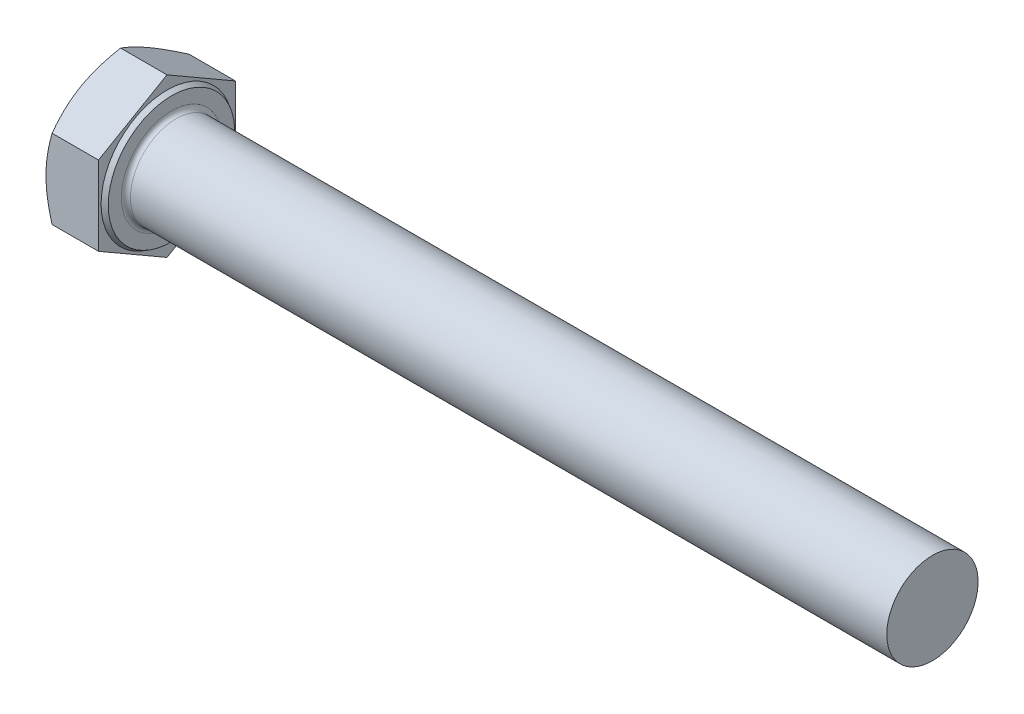
ISO-10303-21;
HEADER;
FILE_DESCRIPTION(('STEP AP214'),'2;1');
FILE_NAME('part.step','',(''),(''),'','','');
FILE_SCHEMA(('AUTOMOTIVE_DESIGN { 1 0 10303 214 1 1 1 1 }'));
ENDSEC;
DATA;
#1=APPLICATION_CONTEXT('core data for automotive mechanical design processes');
#2=APPLICATION_PROTOCOL_DEFINITION('international standard','automotive_design',2000,#1);
#3=PRODUCT_CONTEXT('',#1,'mechanical');
#4=PRODUCT('Part','Part','',(#3));
#5=PRODUCT_RELATED_PRODUCT_CATEGORY('part','',(#4));
#6=PRODUCT_DEFINITION_FORMATION('','',#4);
#7=PRODUCT_DEFINITION_CONTEXT('part definition',#1,'design');
#8=PRODUCT_DEFINITION('design','',#6,#7);
#9=PRODUCT_DEFINITION_SHAPE('','',#8);
#10=(LENGTH_UNIT() NAMED_UNIT(*) SI_UNIT(.MILLI.,.METRE.));
#11=(NAMED_UNIT(*) PLANE_ANGLE_UNIT() SI_UNIT($,.RADIAN.));
#12=(NAMED_UNIT(*) SI_UNIT($,.STERADIAN.) SOLID_ANGLE_UNIT());
#13=UNCERTAINTY_MEASURE_WITH_UNIT(LENGTH_MEASURE(1.E-05),#10,'distance_accuracy_value','');
#14=(GEOMETRIC_REPRESENTATION_CONTEXT(3) GLOBAL_UNCERTAINTY_ASSIGNED_CONTEXT((#13)) GLOBAL_UNIT_ASSIGNED_CONTEXT((#10,
#11,#12)) REPRESENTATION_CONTEXT('',''));
#15=CARTESIAN_POINT('',(0.,0.,0.));
#16=DIRECTION('',(0.,0.,1.));
#17=DIRECTION('',(1.,0.,0.));
#18=AXIS2_PLACEMENT_3D('',#15,#16,#17);
#19=CARTESIAN_POINT('',(7.5,5.19615242270662,-9.));
#20=DIRECTION('',(0.,-0.866025403784438,0.500000000000001));
#21=DIRECTION('',(0.,-0.500000000000001,-0.866025403784438));
#22=AXIS2_PLACEMENT_3D('',#19,#20,#21);
#23=PLANE('',#22);
#24=DIRECTION('',(0.,0.500000000000001,0.866025403784438));
#25=VECTOR('',#24,1.);
#26=CARTESIAN_POINT('',(6.9,5.19615242270662,-9.));
#27=LINE('',#26,#25);
#28=CARTESIAN_POINT('',(6.9,5.19615242270664,-9.));
#29=VERTEX_POINT('',#28);
#30=CARTESIAN_POINT('',(6.9,10.3923048454133,0.));
#31=VERTEX_POINT('',#30);
#32=EDGE_CURVE('E122',#29,#31,#27,.T.);
#33=ORIENTED_EDGE('',*,*,#32,.F.);
#34=DIRECTION('',(-1.,0.,0.));
#35=VECTOR('',#34,1.);
#36=CARTESIAN_POINT('',(7.5,5.19615242270662,-9.));
#37=LINE('',#36,#35);
#38=CARTESIAN_POINT('',(0.803847577293361,5.19615242270662,-9.));
#39=VERTEX_POINT('',#38);
#40=EDGE_CURVE('E271',#29,#39,#37,.T.);
#41=ORIENTED_EDGE('',*,*,#40,.T.);
#42=CARTESIAN_POINT('',(0.803914245071132,10.3924203154671,0.000200000000000029));
#43=CARTESIAN_POINT('',(0.737982001874055,10.2782163639798,-0.197607046401217));
#44=CARTESIAN_POINT('',(0.675041409210312,10.1635669787649,-0.396185606649945));
#45=CARTESIAN_POINT('',(0.555968997655536,9.93333715083391,-0.79495536604421));
#46=CARTESIAN_POINT('',(0.499840117752062,9.81775632901308,-0.99514722181845));
#47=CARTESIAN_POINT('',(0.395151960728962,9.58544915100228,-1.3975150570961));
#48=CARTESIAN_POINT('',(0.346610772912786,9.46872074181186,-1.5996945925006));
#49=CARTESIAN_POINT('',(0.25814851678792,9.23447001335913,-2.00542875589075));
#50=CARTESIAN_POINT('',(0.218225687483274,9.11694786135374,-2.20898309417891));
#51=CARTESIAN_POINT('',(0.148684674147114,8.88408932604662,-2.61230590830691));
#52=CARTESIAN_POINT('',(0.118837502847799,8.76877014301847,-2.812044592399));
#53=CARTESIAN_POINT('',(0.0687933098590807,8.53761579013205,-3.21241567598899));
#54=CARTESIAN_POINT('',(0.048595435537539,8.42178066677662,-3.4130479949416));
#55=CARTESIAN_POINT('',(0.0183543473973465,8.18990950036671,-3.81466063597382));
#56=CARTESIAN_POINT('',(0.0082996095843025,8.07387383570153,-4.01564030266393));
#57=CARTESIAN_POINT('',(-0.00143766485491865,7.84169571742973,-4.41778459991642));
#58=CARTESIAN_POINT('',(-0.00112052193524493,7.72555326723328,-4.61894922457222));
#59=CARTESIAN_POINT('',(0.00916395215317158,7.50842142195782,-4.9950326125305));
#60=CARTESIAN_POINT('',(0.0178767400303951,7.40741671639993,-5.16997789436029));
#61=CARTESIAN_POINT('',(0.0429773400653677,7.20564389241818,-5.51945867708335));
#62=CARTESIAN_POINT('',(0.0593656695806673,7.10487579040239,-5.69399414955697));
#63=CARTESIAN_POINT('',(0.119656556235828,6.80296159398079,-6.2169248772855));
#64=CARTESIAN_POINT('',(0.174677482341126,6.60234990505054,-6.56439451510491));
#65=CARTESIAN_POINT('',(0.312230476325148,6.1989985076226,-7.263019628754));
#66=CARTESIAN_POINT('',(0.395345618627104,5.99631027619253,-7.61408594368717));
#67=CARTESIAN_POINT('',(0.583982539436458,5.59395639760763,-8.3109833040186));
#68=CARTESIAN_POINT('',(0.689460012893352,5.39428559809852,-8.65682327355628));
#69=CARTESIAN_POINT('',(0.803914245071126,5.19603695265279,-9.0002));
#70=B_SPLINE_CURVE_WITH_KNOTS('',3,(#42,#43,#44,#45,#46,#47,#48,#49,#50,#51,#52,#53,#54,#55,#56,
#57,#58,#59,#60,#61,#62,#63,#64,#65,#66,#67,#68,#69),.UNSPECIFIED.,.F.,.F.,(4,2,2,2,2,2,2,2,2,2,
2,2,2,4),(0.,0.713219249102578,1.42674513853509,2.14194697262263,2.85700253034481,
3.55449749123034,4.25193080859215,4.94857085059645,5.64518936892663,6.25162976378284,
6.85811104066341,8.07193747617894,9.31268391793542,10.5509947443908),.UNSPECIFIED.);
#71=CARTESIAN_POINT('',(0.,7.79422863405994,-4.50000000000001));
#72=VERTEX_POINT('',#71);
#73=EDGE_CURVE('E180',#72,#39,#70,.T.);
#74=ORIENTED_EDGE('',*,*,#73,.F.);
#75=CARTESIAN_POINT('',(0.803847577293367,10.3923048454133,0.));
#76=VERTEX_POINT('',#75);
#77=EDGE_CURVE('E68',#76,#72,#70,.T.);
#78=ORIENTED_EDGE('',*,*,#77,.F.);
#79=DIRECTION('',(-1.,0.,0.));
#80=VECTOR('',#79,1.);
#81=CARTESIAN_POINT('',(7.5,10.3923048454133,0.));
#82=LINE('',#81,#80);
#83=EDGE_CURVE('E141',#31,#76,#82,.T.);
#84=ORIENTED_EDGE('',*,*,#83,.F.);
#85=EDGE_LOOP('',(#33,#41,#74,#78,#84));
#86=FACE_BOUND('',#85,.T.);
#87=ADVANCED_FACE('F45',(#86),#23,.F.);
#88=CARTESIAN_POINT('',(7.5,10.3923048454133,0.));
#89=DIRECTION('',(0.,-0.866025403784438,-0.500000000000001));
#90=DIRECTION('',(0.,0.500000000000001,-0.866025403784438));
#91=AXIS2_PLACEMENT_3D('',#88,#89,#90);
#92=PLANE('',#91);
#93=DIRECTION('',(0.,-0.500000000000001,0.866025403784438));
#94=VECTOR('',#93,1.);
#95=CARTESIAN_POINT('',(6.9,10.3923048454133,0.));
#96=LINE('',#95,#94);
#97=CARTESIAN_POINT('',(6.9,5.19615242270665,9.));
#98=VERTEX_POINT('',#97);
#99=EDGE_CURVE('E116',#31,#98,#96,.T.);
#100=ORIENTED_EDGE('',*,*,#99,.F.);
#101=ORIENTED_EDGE('',*,*,#83,.T.);
#102=CARTESIAN_POINT('',(0.803914245071126,5.19603695265279,9.0002));
#103=CARTESIAN_POINT('',(0.737982001874048,5.31024090414013,8.80239295359878));
#104=CARTESIAN_POINT('',(0.675041409210306,5.42489028935503,8.60381439335005));
#105=CARTESIAN_POINT('',(0.555968997655531,5.65512011728599,8.20504463395579));
#106=CARTESIAN_POINT('',(0.499840117752058,5.77070093910682,8.00485277818155));
#107=CARTESIAN_POINT('',(0.395151960728958,6.00300811711761,7.6024849429039));
#108=CARTESIAN_POINT('',(0.346610772912782,6.11973652630803,7.4003054074994));
#109=CARTESIAN_POINT('',(0.258148516787916,6.35398725476077,6.99457124410925));
#110=CARTESIAN_POINT('',(0.218225687483269,6.47150940676615,6.79101690582109));
#111=CARTESIAN_POINT('',(0.148684674147111,6.70436794207328,6.38769409169309));
#112=CARTESIAN_POINT('',(0.118837502847797,6.81968712510142,6.187955407601));
#113=CARTESIAN_POINT('',(0.0687933098590795,7.05084147798785,5.787584324011));
#114=CARTESIAN_POINT('',(0.0485954355375369,7.16667660134328,5.58695200505839));
#115=CARTESIAN_POINT('',(0.0183543473973446,7.39854776775318,5.18533936402618));
#116=CARTESIAN_POINT('',(0.00829960958430167,7.51458343241836,4.98435969733606));
#117=CARTESIAN_POINT('',(-0.00143766485491882,7.74676155069016,4.58221540008358));
#118=CARTESIAN_POINT('',(-0.00112052193524554,7.86290400088662,4.38105077542778));
#119=CARTESIAN_POINT('',(0.00916395215317118,8.08003584616208,4.0049673874695));
#120=CARTESIAN_POINT('',(0.0178767400303952,8.18104055171996,3.83002210563971));
#121=CARTESIAN_POINT('',(0.0429773400653688,8.38281337570172,3.48054132291665));
#122=CARTESIAN_POINT('',(0.0593656695806689,8.4835814777175,3.30600585044303));
#123=CARTESIAN_POINT('',(0.119656556235831,8.7854956741391,2.7830751227145));
#124=CARTESIAN_POINT('',(0.174677482341129,8.98610736306936,2.43560548489509));
#125=CARTESIAN_POINT('',(0.312230476325152,9.38945876049729,1.736980371246));
#126=CARTESIAN_POINT('',(0.395345618627108,9.59214699192737,1.38591405631283));
#127=CARTESIAN_POINT('',(0.583982539436463,9.99450087051226,0.689016695981395));
#128=CARTESIAN_POINT('',(0.689460012893358,10.1941716700214,0.343176726443721));
#129=CARTESIAN_POINT('',(0.803914245071132,10.3924203154671,-0.000200000000000193));
#130=B_SPLINE_CURVE_WITH_KNOTS('',3,(#102,#103,#104,#105,#106,#107,#108,#109,#110,#111,#112,
#113,#114,#115,#116,#117,#118,#119,#120,#121,#122,#123,#124,#125,#126,#127,#128,#129),
.UNSPECIFIED.,.F.,.F.,(4,2,2,2,2,2,2,2,2,2,2,2,2,4),(0.,0.713219249102577,1.42674513853509,
2.14194697262263,2.8570025303448,3.55449749123034,4.25193080859215,4.94857085059645,
5.64518936892662,6.25162976378284,6.8581110406634,8.07193747617894,9.31268391793542,
10.5509947443908),.UNSPECIFIED.);
#131=CARTESIAN_POINT('',(0.,7.79422863405994,4.50000000000001));
#132=VERTEX_POINT('',#131);
#133=EDGE_CURVE('E228',#132,#76,#130,.T.);
#134=ORIENTED_EDGE('',*,*,#133,.F.);
#135=CARTESIAN_POINT('',(0.803847577293361,5.19615242270663,9.));
#136=VERTEX_POINT('',#135);
#137=EDGE_CURVE('E140',#136,#132,#130,.T.);
#138=ORIENTED_EDGE('',*,*,#137,.F.);
#139=DIRECTION('',(-1.,0.,0.));
#140=VECTOR('',#139,1.);
#141=CARTESIAN_POINT('',(7.5,5.19615242270663,9.));
#142=LINE('',#141,#140);
#143=EDGE_CURVE('E131',#98,#136,#142,.T.);
#144=ORIENTED_EDGE('',*,*,#143,.F.);
#145=EDGE_LOOP('',(#100,#101,#134,#138,#144));
#146=FACE_BOUND('',#145,.T.);
#147=ADVANCED_FACE('F138',(#146),#92,.F.);
#148=CARTESIAN_POINT('',(7.5,5.19615242270663,9.));
#149=DIRECTION('',(0.,0.,-1.));
#150=DIRECTION('',(-1.,0.,0.));
#151=AXIS2_PLACEMENT_3D('',#148,#149,#150);
#152=PLANE('',#151);
#153=DIRECTION('',(0.,-1.,0.));
#154=VECTOR('',#153,1.);
#155=CARTESIAN_POINT('',(6.9,5.19615242270663,9.));
#156=LINE('',#155,#154);
#157=CARTESIAN_POINT('',(6.9,-5.19615242270663,9.00000000000001));
#158=VERTEX_POINT('',#157);
#159=EDGE_CURVE('E119',#98,#158,#156,.T.);
#160=ORIENTED_EDGE('',*,*,#159,.F.);
#161=ORIENTED_EDGE('',*,*,#143,.T.);
#162=CARTESIAN_POINT('',(4.50308345116277,-14.1853984650015,9.));
#163=CARTESIAN_POINT('',(4.31054430443784,-13.7903499522352,9.));
#164=CARTESIAN_POINT('',(4.11978647586973,-13.3944187196266,9.));
#165=CARTESIAN_POINT('',(3.74283090620237,-12.6003222266755,9.));
#166=CARTESIAN_POINT('',(3.55663384146594,-12.2021566456113,9.));
#167=CARTESIAN_POINT('',(3.18890856344589,-11.4011783965729,9.));
#168=CARTESIAN_POINT('',(3.0074093906765,-10.9983523517116,9.));
#169=CARTESIAN_POINT('',(2.65153988681449,-10.1895752665153,9.));
#170=CARTESIAN_POINT('',(2.47716923358453,-9.78362436837965,9.));
#171=CARTESIAN_POINT('',(2.13161244926931,-8.95398189189403,9.));
#172=CARTESIAN_POINT('',(1.96074001408349,-8.53015895315935,9.));
#173=CARTESIAN_POINT('',(1.6313841002326,-7.67764040403063,9.));
#174=CARTESIAN_POINT('',(1.47290197976962,-7.24894426532906,9.));
#175=CARTESIAN_POINT('',(1.1723215513794,-6.38672363138017,9.));
#176=CARTESIAN_POINT('',(1.03019194474471,-5.95321016213062,9.));
#177=CARTESIAN_POINT('',(0.766724668389709,-5.07998336095627,9.));
#178=CARTESIAN_POINT('',(0.64538068545207,-4.64027195560257,9.));
#179=CARTESIAN_POINT('',(0.429822600041212,-3.75682505769699,9.));
#180=CARTESIAN_POINT('',(0.335452586446514,-3.31312863828559,9.));
#181=CARTESIAN_POINT('',(0.218090109997794,-2.64336713305662,9.));
#182=CARTESIAN_POINT('',(0.182999862158403,-2.41939560703655,9.));
#183=CARTESIAN_POINT('',(0.12156566735783,-1.97026354386692,9.));
#184=CARTESIAN_POINT('',(0.0952208701204452,-1.7451031244712,9.));
#185=CARTESIAN_POINT('',(0.052145147227862,-1.29693480879163,9.));
#186=CARTESIAN_POINT('',(0.0352889798642686,-1.07393900194963,9.));
#187=CARTESIAN_POINT('',(0.0110310639342788,-0.627433600763166,9.));
#188=CARTESIAN_POINT('',(0.00362915208926389,-0.403924015358644,9.));
#189=CARTESIAN_POINT('',(-0.00154262379217612,0.0432079361744755,9.));
#190=CARTESIAN_POINT('',(0.000687480645622417,0.266830301931546,9.));
#191=CARTESIAN_POINT('',(0.0147226077234483,0.713776872824048,9.));
#192=CARTESIAN_POINT('',(0.0265280659472987,0.937101063932557,9.));
#193=CARTESIAN_POINT('',(0.065650289857184,1.46707211896633,9.));
#194=CARTESIAN_POINT('',(0.0971347677291179,1.77341845056799,9.));
#195=CARTESIAN_POINT('',(0.176454333238002,2.38397028008964,9.));
#196=CARTESIAN_POINT('',(0.224291457717819,2.68817550649947,9.));
#197=CARTESIAN_POINT('',(0.389806402965321,3.59715813116673,9.));
#198=CARTESIAN_POINT('',(0.529461896846409,4.1979941265223,9.));
#199=CARTESIAN_POINT('',(0.773331871848964,5.09670706348808,9.));
#200=CARTESIAN_POINT('',(0.861532431142624,5.39919910543193,9.));
#201=CARTESIAN_POINT('',(1.04752099203162,6.00125026101993,9.));
#202=CARTESIAN_POINT('',(1.14530906206942,6.30080935370982,9.));
#203=CARTESIAN_POINT('',(1.34886866039495,6.89708058771339,9.));
#204=CARTESIAN_POINT('',(1.4546378769001,7.19379352557784,9.));
#205=CARTESIAN_POINT('',(1.67287301968739,7.78473287386441,9.));
#206=CARTESIAN_POINT('',(1.78533883473292,8.07895932549667,9.));
#207=CARTESIAN_POINT('',(2.07523735271453,8.81619444901846,9.));
#208=CARTESIAN_POINT('',(2.25629467011384,9.25777584408893,9.));
#209=CARTESIAN_POINT('',(2.62827522263086,10.1367776511577,9.));
#210=CARTESIAN_POINT('',(2.81919928705197,10.5741977097237,9.));
#211=CARTESIAN_POINT('',(3.20877963371491,11.4457286497122,9.));
#212=CARTESIAN_POINT('',(3.40743823107646,11.8798384930871,9.));
#213=CARTESIAN_POINT('',(3.81079737205717,12.7452179469075,9.));
#214=CARTESIAN_POINT('',(4.01549773502307,13.1764876418049,9.));
#215=CARTESIAN_POINT('',(4.43000777500987,14.0372827141757,9.));
#216=CARTESIAN_POINT('',(4.63982402220294,14.466804921625,9.));
#217=CARTESIAN_POINT('',(5.0633687133929,15.3239162694583,9.));
#218=CARTESIAN_POINT('',(5.27709718099327,15.7515053981602,9.));
#219=CARTESIAN_POINT('',(5.70771289609102,16.6049951424422,9.));
#220=CARTESIAN_POINT('',(5.92459958876704,17.0308960382694,9.));
#221=CARTESIAN_POINT('',(6.36101693257489,17.8813418239716,9.));
#222=CARTESIAN_POINT('',(6.58054759472945,18.305886708184,9.));
#223=CARTESIAN_POINT('',(7.20096689356043,19.4981240117253,9.));
#224=CARTESIAN_POINT('',(7.60436223424865,20.2645118375987,9.));
#225=CARTESIAN_POINT('',(8.41646747703506,21.7945065925678,9.));
#226=CARTESIAN_POINT('',(8.82517763220602,22.558113387008,9.));
#227=CARTESIAN_POINT('',(9.6453899211846,24.08088542414,9.));
#228=CARTESIAN_POINT('',(10.0568800806834,24.8400571209878,9.));
#229=CARTESIAN_POINT('',(10.6764233675492,25.9775231898088,9.));
#230=CARTESIAN_POINT('',(10.8833155902988,26.3564507889065,9.));
#231=CARTESIAN_POINT('',(11.2977907102886,27.1139273756374,9.));
#232=CARTESIAN_POINT('',(11.5053736065156,27.492476363825,9.));
#233=CARTESIAN_POINT('',(11.7132605802833,27.8708583347745,9.));
#234=B_SPLINE_CURVE_WITH_KNOTS('',3,(#162,#163,#164,#165,#166,#167,#168,#169,#170,#171,#172,
#173,#174,#175,#176,#177,#178,#179,#180,#181,#182,#183,#184,#185,#186,#187,#188,#189,#190,#191,
#192,#193,#194,#195,#196,#197,#198,#199,#200,#201,#202,#203,#204,#205,#206,#207,#208,#209,#210,
#211,#212,#213,#214,#215,#216,#217,#218,#219,#220,#221,#222,#223,#224,#225,#226,#227,#228,#229,
#230,#231,#232,#233),.UNSPECIFIED.,.F.,.F.,(4,2,2,2,2,2,2,2,2,2,2,2,2,2,2,2,2,2,2,2,2,2,2,2,2,2,
2,2,2,2,2,2,2,2,2,4),(0.,1.31842765114838,2.6370496560634,3.96247407620815,5.28783853415268,
6.65860358746619,8.02951869129603,9.39776460603693,10.7655942037288,12.1253499441535,
12.8053173169584,13.4852185605779,14.1559216013657,14.8266130586982,15.4973023208461,
16.1680220944284,17.0913849082023,18.0148627755644,19.862742604473,20.8079230410616,
21.75311022551,22.6980246745777,23.6429234321322,25.0745302305723,26.5062575523684,
27.9384167676661,29.3705332036396,30.8045973553514,32.2386701620091,33.6724940065179,
35.1063238307244,37.7045032490067,40.3028068397952,42.8933552129343,44.1885437295509,
45.4837303472314),.UNSPECIFIED.);
#235=CARTESIAN_POINT('',(0.,0.,9.));
#236=VERTEX_POINT('',#235);
#237=EDGE_CURVE('E233',#236,#136,#234,.T.);
#238=ORIENTED_EDGE('',*,*,#237,.F.);
#239=CARTESIAN_POINT('',(0.803847577293364,-5.19615242270664,9.));
#240=VERTEX_POINT('',#239);
#241=EDGE_CURVE('E239',#240,#236,#234,.T.);
#242=ORIENTED_EDGE('',*,*,#241,.F.);
#243=DIRECTION('',(-1.,0.,0.));
#244=VECTOR('',#243,1.);
#245=CARTESIAN_POINT('',(7.5,-5.19615242270664,9.));
#246=LINE('',#245,#244);
#247=EDGE_CURVE('E134',#158,#240,#246,.T.);
#248=ORIENTED_EDGE('',*,*,#247,.F.);
#249=EDGE_LOOP('',(#160,#161,#238,#242,#248));
#250=FACE_BOUND('',#249,.T.);
#251=ADVANCED_FACE('F129',(#250),#152,.F.);
#252=CARTESIAN_POINT('',(7.5,-10.3923048454133,0.));
#253=DIRECTION('',(0.,0.866025403784438,-0.500000000000001));
#254=DIRECTION('',(0.,0.500000000000001,0.866025403784438));
#255=AXIS2_PLACEMENT_3D('',#252,#253,#254);
#256=PLANE('',#255);
#257=DIRECTION('',(0.,-0.500000000000001,-0.866025403784438));
#258=VECTOR('',#257,1.);
#259=CARTESIAN_POINT('',(6.9,-10.3923048454133,0.));
#260=LINE('',#259,#258);
#261=CARTESIAN_POINT('',(6.9,-10.3923048454133,0.));
#262=VERTEX_POINT('',#261);
#263=EDGE_CURVE('E135',#158,#262,#260,.T.);
#264=ORIENTED_EDGE('',*,*,#263,.F.);
#265=ORIENTED_EDGE('',*,*,#247,.T.);
#266=CARTESIAN_POINT('',(0.80391424507114,-10.3924203154671,-0.000200000000000088));
#267=CARTESIAN_POINT('',(0.737982001874061,-10.2782163639798,0.197607046401216));
#268=CARTESIAN_POINT('',(0.675041409210319,-10.1635669787649,0.396185606649945));
#269=CARTESIAN_POINT('',(0.555968997655543,-9.93333715083392,0.794955366044209));
#270=CARTESIAN_POINT('',(0.499840117752069,-9.81775632901309,0.99514722181845));
#271=CARTESIAN_POINT('',(0.395151960728969,-9.58544915100229,1.3975150570961));
#272=CARTESIAN_POINT('',(0.346610772912792,-9.46872074181187,1.5996945925006));
#273=CARTESIAN_POINT('',(0.258148516787926,-9.23447001335914,2.00542875589075));
#274=CARTESIAN_POINT('',(0.21822568748328,-9.11694786135375,2.20898309417891));
#275=CARTESIAN_POINT('',(0.148684674147121,-8.88408932604663,2.61230590830692));
#276=CARTESIAN_POINT('',(0.118837502847806,-8.76877014301848,2.81204459239901));
#277=CARTESIAN_POINT('',(0.0687933098590875,-8.53761579013205,3.212415675989));
#278=CARTESIAN_POINT('',(0.0485954355375451,-8.42178066677663,3.41304799494161));
#279=CARTESIAN_POINT('',(0.0183543473973519,-8.18990950036672,3.81466063597382));
#280=CARTESIAN_POINT('',(0.00829960958430803,-8.07387383570154,4.01564030266394));
#281=CARTESIAN_POINT('',(-0.00143766485491315,-7.84169571742974,4.41778459991643));
#282=CARTESIAN_POINT('',(-0.00112052193523958,-7.72555326723329,4.61894922457223));
#283=CARTESIAN_POINT('',(0.0091639521531772,-7.50842142195783,4.99503261253051));
#284=CARTESIAN_POINT('',(0.017876740030401,-7.40741671639994,5.16997789436029));
#285=CARTESIAN_POINT('',(0.0429773400653737,-7.20564389241819,5.51945867708335));
#286=CARTESIAN_POINT('',(0.0593656695806731,-7.1048757904024,5.69399414955697));
#287=CARTESIAN_POINT('',(0.119656556235833,-6.8029615939808,6.21692487728551));
#288=CARTESIAN_POINT('',(0.174677482341132,-6.60234990505054,6.56439451510492));
#289=CARTESIAN_POINT('',(0.312230476325153,-6.19899850762261,7.263019628754));
#290=CARTESIAN_POINT('',(0.395345618627109,-5.99631027619254,7.61408594368717));
#291=CARTESIAN_POINT('',(0.583982539436461,-5.59395639760764,8.3109833040186));
#292=CARTESIAN_POINT('',(0.689460012893356,-5.39428559809853,8.65682327355628));
#293=CARTESIAN_POINT('',(0.803914245071129,-5.1960369526528,9.0002));
#294=B_SPLINE_CURVE_WITH_KNOTS('',3,(#266,#267,#268,#269,#270,#271,#272,#273,#274,#275,#276,
#277,#278,#279,#280,#281,#282,#283,#284,#285,#286,#287,#288,#289,#290,#291,#292,#293),
.UNSPECIFIED.,.F.,.F.,(4,2,2,2,2,2,2,2,2,2,2,2,2,4),(0.,0.713219249102578,1.42674513853509,
2.14194697262263,2.85700253034481,3.55449749123035,4.25193080859215,4.94857085059646,
5.64518936892664,6.25162976378285,6.85811104066341,8.07193747617895,9.31268391793542,
10.5509947443908),.UNSPECIFIED.);
#295=CARTESIAN_POINT('',(0.,-7.79422863405994,4.50000000000001));
#296=VERTEX_POINT('',#295);
#297=EDGE_CURVE('E240',#296,#240,#294,.T.);
#298=ORIENTED_EDGE('',*,*,#297,.F.);
#299=CARTESIAN_POINT('',(0.803847577293375,-10.3923048454133,0.));
#300=VERTEX_POINT('',#299);
#301=EDGE_CURVE('E196',#300,#296,#294,.T.);
#302=ORIENTED_EDGE('',*,*,#301,.F.);
#303=DIRECTION('',(-1.,0.,0.));
#304=VECTOR('',#303,1.);
#305=CARTESIAN_POINT('',(7.5,-10.3923048454133,0.));
#306=LINE('',#305,#304);
#307=EDGE_CURVE('E145',#262,#300,#306,.T.);
#308=ORIENTED_EDGE('',*,*,#307,.F.);
#309=EDGE_LOOP('',(#264,#265,#298,#302,#308));
#310=FACE_BOUND('',#309,.T.);
#311=ADVANCED_FACE('F245',(#310),#256,.F.);
#312=CARTESIAN_POINT('',(7.5,-5.19615242270664,-9.));
#313=DIRECTION('',(0.,0.866025403784438,0.5));
#314=DIRECTION('',(0.,-0.5,0.866025403784438));
#315=AXIS2_PLACEMENT_3D('',#312,#313,#314);
#316=PLANE('',#315);
#317=DIRECTION('',(0.,0.5,-0.866025403784438));
#318=VECTOR('',#317,1.);
#319=CARTESIAN_POINT('',(6.9,-5.19615242270664,-9.));
#320=LINE('',#319,#318);
#321=CARTESIAN_POINT('',(6.9,-5.19615242270664,-9.));
#322=VERTEX_POINT('',#321);
#323=EDGE_CURVE('E60',#262,#322,#320,.T.);
#324=ORIENTED_EDGE('',*,*,#323,.F.);
#325=ORIENTED_EDGE('',*,*,#307,.T.);
#326=CARTESIAN_POINT('',(0.803914245071133,-5.19603695265281,-9.0002));
#327=CARTESIAN_POINT('',(0.737982001874055,-5.31024090414015,-8.80239295359879));
#328=CARTESIAN_POINT('',(0.675041409210313,-5.42489028935504,-8.60381439335006));
#329=CARTESIAN_POINT('',(0.555968997655538,-5.65512011728601,-8.20504463395579));
#330=CARTESIAN_POINT('',(0.499840117752064,-5.77070093910683,-8.00485277818155));
#331=CARTESIAN_POINT('',(0.395151960728964,-6.00300811711763,-7.6024849429039));
#332=CARTESIAN_POINT('',(0.346610772912788,-6.11973652630805,-7.4003054074994));
#333=CARTESIAN_POINT('',(0.258148516787923,-6.35398725476078,-6.99457124410925));
#334=CARTESIAN_POINT('',(0.218225687483277,-6.47150940676617,-6.79101690582109));
#335=CARTESIAN_POINT('',(0.148684674147118,-6.70436794207329,-6.38769409169308));
#336=CARTESIAN_POINT('',(0.118837502847804,-6.81968712510144,-6.187955407601));
#337=CARTESIAN_POINT('',(0.0687933098590869,-7.05084147798787,-5.787584324011));
#338=CARTESIAN_POINT('',(0.048595435537545,-7.1666766013433,-5.58695200505839));
#339=CARTESIAN_POINT('',(0.018354347397353,-7.3985477677532,-5.18533936402618));
#340=CARTESIAN_POINT('',(0.0082996095843099,-7.51458343241838,-4.98435969733606));
#341=CARTESIAN_POINT('',(-0.00143766485491054,-7.74676155069018,-4.58221540008358));
#342=CARTESIAN_POINT('',(-0.00112052193523694,-7.86290400088664,-4.38105077542778));
#343=CARTESIAN_POINT('',(0.00916395215318055,-8.08003584616209,-4.0049673874695));
#344=CARTESIAN_POINT('',(0.017876740030405,-8.18104055171998,-3.83002210563971));
#345=CARTESIAN_POINT('',(0.0429773400653788,-8.38281337570174,-3.48054132291665));
#346=CARTESIAN_POINT('',(0.0593656695806787,-8.48358147771752,-3.30600585044303));
#347=CARTESIAN_POINT('',(0.11965655623584,-8.78549567413912,-2.78307512271449));
#348=CARTESIAN_POINT('',(0.174677482341138,-8.98610736306938,-2.43560548489508));
#349=CARTESIAN_POINT('',(0.312230476325161,-9.38945876049731,-1.736980371246));
#350=CARTESIAN_POINT('',(0.395345618627117,-9.59214699192738,-1.38591405631283));
#351=CARTESIAN_POINT('',(0.583982539436471,-9.99450087051228,-0.689016695981392));
#352=CARTESIAN_POINT('',(0.689460012893366,-10.1941716700214,-0.343176726443719));
#353=CARTESIAN_POINT('',(0.803914245071141,-10.3924203154671,0.000200000000001774));
#354=B_SPLINE_CURVE_WITH_KNOTS('',3,(#326,#327,#328,#329,#330,#331,#332,#333,#334,#335,#336,
#337,#338,#339,#340,#341,#342,#343,#344,#345,#346,#347,#348,#349,#350,#351,#352,#353),
.UNSPECIFIED.,.F.,.F.,(4,2,2,2,2,2,2,2,2,2,2,2,2,4),(0.,0.713219249102577,1.42674513853509,
2.14194697262263,2.85700253034481,3.55449749123034,4.25193080859215,4.94857085059645,
5.64518936892663,6.25162976378284,6.85811104066341,8.07193747617895,9.31268391793542,
10.5509947443908),.UNSPECIFIED.);
#355=CARTESIAN_POINT('',(0.,-7.79422863405994,-4.5));
#356=VERTEX_POINT('',#355);
#357=EDGE_CURVE('E290',#356,#300,#354,.T.);
#358=ORIENTED_EDGE('',*,*,#357,.F.);
#359=CARTESIAN_POINT('',(0.803847577293113,-5.19615242270703,-9.));
#360=VERTEX_POINT('',#359);
#361=EDGE_CURVE('E189',#360,#356,#354,.T.);
#362=ORIENTED_EDGE('',*,*,#361,.F.);
#363=DIRECTION('',(-1.,0.,0.));
#364=VECTOR('',#363,1.);
#365=CARTESIAN_POINT('',(7.5,-5.19615242270664,-9.));
#366=LINE('',#365,#364);
#367=EDGE_CURVE('E272',#322,#360,#366,.T.);
#368=ORIENTED_EDGE('',*,*,#367,.F.);
#369=EDGE_LOOP('',(#324,#325,#358,#362,#368));
#370=FACE_BOUND('',#369,.T.);
#371=ADVANCED_FACE('F248',(#370),#316,.F.);
#372=CARTESIAN_POINT('',(7.5,5.19615242270662,-9.));
#373=DIRECTION('',(0.,0.,1.));
#374=DIRECTION('',(0.,-1.,0.));
#375=AXIS2_PLACEMENT_3D('',#372,#373,#374);
#376=PLANE('',#375);
#377=DIRECTION('',(0.,1.,0.));
#378=VECTOR('',#377,1.);
#379=CARTESIAN_POINT('',(6.9,5.19615242270662,-9.));
#380=LINE('',#379,#378);
#381=EDGE_CURVE('E153',#322,#29,#380,.T.);
#382=ORIENTED_EDGE('',*,*,#381,.F.);
#383=ORIENTED_EDGE('',*,*,#367,.T.);
#384=CARTESIAN_POINT('',(4.50308345606078,-14.1853984750485,-9.));
#385=CARTESIAN_POINT('',(4.31054430913195,-13.7903499619441,-9.));
#386=CARTESIAN_POINT('',(4.11978648036007,-13.3944187289973,-9.));
#387=CARTESIAN_POINT('',(3.74283091028612,-12.6003222353684,-9.));
#388=CARTESIAN_POINT('',(3.55663384534689,-12.2021566539649,-9.));
#389=CARTESIAN_POINT('',(3.18890856692114,-11.4011784042428,-9.));
#390=CARTESIAN_POINT('',(3.00740939394888,-10.998352359037,-9.));
#391=CARTESIAN_POINT('',(2.65153988968446,-10.1895752731496,-9.));
#392=CARTESIAN_POINT('',(2.47716923625496,-9.78362437466718,-9.));
#393=CARTESIAN_POINT('',(2.13161245153419,-8.95398189745991,-9.));
#394=CARTESIAN_POINT('',(1.96074001614284,-8.53015895835008,-9.));
#395=CARTESIAN_POINT('',(1.63138410189175,-7.6776404084651,-9.));
#396=CARTESIAN_POINT('',(1.4729019812341,-7.24894426938241,-9.));
#397=CARTESIAN_POINT('',(1.17232155247294,-6.38672363466423,-9.));
#398=CARTESIAN_POINT('',(1.03019194566191,-5.95321016502653,-9.));
#399=CARTESIAN_POINT('',(0.766724668982651,-5.07998336306547,-9.));
#400=CARTESIAN_POINT('',(0.645380685897063,-4.64027195731318,-9.));
#401=CARTESIAN_POINT('',(0.4298226001874,-3.75682505840835,-9.));
#402=CARTESIAN_POINT('',(0.335452586452976,-3.31312863839349,-9.));
#403=CARTESIAN_POINT('',(0.218090109862416,-2.64336713224849,-9.));
#404=CARTESIAN_POINT('',(0.182999861987048,-2.41939560592137,-9.));
#405=CARTESIAN_POINT('',(0.121565667139732,-1.97026354213498,-9.));
#406=CARTESIAN_POINT('',(0.0952208698915757,-1.74510312242953,-9.));
#407=CARTESIAN_POINT('',(0.0521451470049084,-1.29693480613702,-9.));
#408=CARTESIAN_POINT('',(0.0352889796574918,-1.07393899899183,-9.));
#409=CARTESIAN_POINT('',(0.011031063786748,-0.627433597199465,-9.));
#410=CARTESIAN_POINT('',(0.00362915198480189,-0.403924011492238,-9.));
#411=CARTESIAN_POINT('',(-0.00154262378413789,0.0432079406441061,-9.));
#412=CARTESIAN_POINT('',(0.000687480723096177,0.266830306701696,-9.));
#413=CARTESIAN_POINT('',(0.0147226079643592,0.713776878191375,-9.));
#414=CARTESIAN_POINT('',(0.0265280662822136,0.937101069596543,-9.));
#415=CARTESIAN_POINT('',(0.0656502904232108,1.46707212508443,-9.));
#416=CARTESIAN_POINT('',(0.0971347684278843,1.77341845684227,-9.));
#417=CARTESIAN_POINT('',(0.176454334209291,2.38397028666908,-9.));
#418=CARTESIAN_POINT('',(0.224291458828894,2.6881755132279,-9.));
#419=CARTESIAN_POINT('',(0.389806404498591,3.59715813833381,-9.));
#420=CARTESIAN_POINT('',(0.52946189866475,4.19799413397004,-9.));
#421=CARTESIAN_POINT('',(0.773331874087601,5.09670707135543,-9.));
#422=CARTESIAN_POINT('',(0.861532433522244,5.39919911344212,-9.));
#423=CARTESIAN_POINT('',(1.04752099468878,6.00125026931415,-9.));
#424=CARTESIAN_POINT('',(1.14530906486313,6.30080936214523,-9.));
#425=CARTESIAN_POINT('',(1.34886866345677,6.89708059643009,-9.));
#426=CARTESIAN_POINT('',(1.45463788009346,7.19379353443466,-9.));
#427=CARTESIAN_POINT('',(1.67287302313913,7.78473288300146,-9.));
#428=CARTESIAN_POINT('',(1.78533883831151,8.07895933477384,-9.));
#429=CARTESIAN_POINT('',(2.07523735650254,8.81619445838354,-9.));
#430=CARTESIAN_POINT('',(2.25629467397395,9.25777585340505,-9.));
#431=CARTESIAN_POINT('',(2.6282752266166,10.1367776603819,-9.));
#432=CARTESIAN_POINT('',(2.81919929109124,10.5741977189049,-9.));
#433=CARTESIAN_POINT('',(3.20877963784731,11.4457286588119,-9.));
#434=CARTESIAN_POINT('',(3.40743823524846,11.8798385021483,-9.));
#435=CARTESIAN_POINT('',(3.81079737629817,12.7452179558959,-9.));
#436=CARTESIAN_POINT('',(4.01549773929348,13.1764876507589,-9.));
#437=CARTESIAN_POINT('',(4.43000777933055,14.0372827230624,-9.));
#438=CARTESIAN_POINT('',(4.63982402654444,14.4668049304786,-9.));
#439=CARTESIAN_POINT('',(5.06336871777017,15.3239162782486,-9.));
#440=CARTESIAN_POINT('',(5.27709718538547,15.7515054069201,-9.));
#441=CARTESIAN_POINT('',(5.70771290050867,16.6049951511436,-9.));
#442=CARTESIAN_POINT('',(5.92459959319522,17.0308960469429,-9.));
#443=CARTESIAN_POINT('',(6.36101693702057,17.8813418325907,-9.));
#444=CARTESIAN_POINT('',(6.58054759918211,18.3058867167768,-9.));
#445=CARTESIAN_POINT('',(7.20096689804885,19.4981240202845,-9.));
#446=CARTESIAN_POINT('',(7.60436223876305,20.264511846152,-9.));
#447=CARTESIAN_POINT('',(8.4164674815957,21.794506601112,-9.));
#448=CARTESIAN_POINT('',(8.82517763678693,22.5581133955489,-9.));
#449=CARTESIAN_POINT('',(9.64538992580601,24.0808854326838,-9.));
#450=CARTESIAN_POINT('',(10.0568800853251,24.8400571295377,-9.));
#451=CARTESIAN_POINT('',(10.6764233722193,25.977523198369,-9.));
#452=CARTESIAN_POINT('',(10.883315594978,26.3564507974703,-9.));
#453=CARTESIAN_POINT('',(11.2977907149855,27.1139273842089,-9.));
#454=CARTESIAN_POINT('',(11.5053736112211,27.4924763724004,-9.));
#455=CARTESIAN_POINT('',(11.7132605849971,27.870858343354,-9.));
#456=B_SPLINE_CURVE_WITH_KNOTS('',3,(#384,#385,#386,#387,#388,#389,#390,#391,#392,#393,#394,
#395,#396,#397,#398,#399,#400,#401,#402,#403,#404,#405,#406,#407,#408,#409,#410,#411,#412,#413,
#414,#415,#416,#417,#418,#419,#420,#421,#422,#423,#424,#425,#426,#427,#428,#429,#430,#431,#432,
#433,#434,#435,#436,#437,#438,#439,#440,#441,#442,#443,#444,#445,#446,#447,#448,#449,#450,#451,
#452,#453,#454,#455),.UNSPECIFIED.,.F.,.F.,(4,2,2,2,2,2,2,2,2,2,2,2,2,2,2,2,2,2,2,2,2,2,2,2,2,2,
2,2,2,2,2,2,2,2,2,4),(0.,1.3184276523281,2.63704965842302,3.96247407975987,5.28783853889642,
6.65860359348418,8.02951869858869,9.39776461460018,10.7655942135616,12.1253499558398,
12.8053173295708,13.4852185741162,14.1559216158065,14.8266130740414,15.4973023370921,
16.1680221115773,17.0913849258576,18.0148627937263,19.8627426236502,20.8079230607688,
21.7531102457472,22.6980246953435,23.6429234534266,25.0745302518135,26.5062575735559,
27.9384167887983,29.3705332247166,30.804597376367,32.2386701829632,33.6724940274114,
35.1063238515574,37.7045032698604,40.3028068606692,42.8933552338532,44.1885437504927,
45.4837303681959),.UNSPECIFIED.);
#457=CARTESIAN_POINT('',(0.,0.,-9.));
#458=VERTEX_POINT('',#457);
#459=EDGE_CURVE('E217',#458,#360,#456,.F.);
#460=ORIENTED_EDGE('',*,*,#459,.F.);
#461=EDGE_CURVE('E298',#39,#458,#456,.F.);
#462=ORIENTED_EDGE('',*,*,#461,.F.);
#463=ORIENTED_EDGE('',*,*,#40,.F.);
#464=EDGE_LOOP('',(#382,#383,#460,#462,#463));
#465=FACE_BOUND('',#464,.T.);
#466=ADVANCED_FACE('F252',(#465),#376,.F.);
#467=CARTESIAN_POINT('',(0.,0.,0.));
#468=DIRECTION('',(1.,0.,0.));
#469=DIRECTION('',(0.,0.,-1.));
#470=AXIS2_PLACEMENT_3D('',#467,#468,#469);
#471=CONICAL_SURFACE('',#470,9.,1.0471975511966);
#472=ORIENTED_EDGE('',*,*,#361,.T.);
#473=CARTESIAN_POINT('',(0.,0.,0.));
#474=DIRECTION('',(1.,0.,0.));
#475=DIRECTION('',(0.,0.,-1.));
#476=AXIS2_PLACEMENT_3D('',#473,#474,#475);
#477=CIRCLE('',#476,9.);
#478=EDGE_CURVE('E143',#356,#458,#477,.T.);
#479=ORIENTED_EDGE('',*,*,#478,.T.);
#480=ORIENTED_EDGE('',*,*,#459,.T.);
#481=EDGE_LOOP('',(#472,#479,#480));
#482=FACE_BOUND('',#481,.T.);
#483=ADVANCED_FACE('F211',(#482),#471,.T.);
#484=ORIENTED_EDGE('',*,*,#301,.T.);
#485=EDGE_CURVE('E151',#296,#356,#477,.T.);
#486=ORIENTED_EDGE('',*,*,#485,.T.);
#487=ORIENTED_EDGE('',*,*,#357,.T.);
#488=EDGE_LOOP('',(#484,#486,#487));
#489=FACE_BOUND('',#488,.T.);
#490=ADVANCED_FACE('F209',(#489),#471,.T.);
#491=ORIENTED_EDGE('',*,*,#241,.T.);
#492=EDGE_CURVE('E277',#236,#296,#477,.T.);
#493=ORIENTED_EDGE('',*,*,#492,.T.);
#494=ORIENTED_EDGE('',*,*,#297,.T.);
#495=EDGE_LOOP('',(#491,#493,#494));
#496=FACE_BOUND('',#495,.T.);
#497=ADVANCED_FACE('F203',(#496),#471,.T.);
#498=ORIENTED_EDGE('',*,*,#237,.T.);
#499=ORIENTED_EDGE('',*,*,#137,.T.);
#500=CARTESIAN_POINT('',(0.,0.,0.));
#501=DIRECTION('',(-1.,0.,0.));
#502=DIRECTION('',(0.,0.,1.));
#503=AXIS2_PLACEMENT_3D('',#500,#501,#502);
#504=CIRCLE('',#503,9.);
#505=EDGE_CURVE('E282',#236,#132,#504,.T.);
#506=ORIENTED_EDGE('',*,*,#505,.F.);
#507=EDGE_LOOP('',(#498,#499,#506));
#508=FACE_BOUND('',#507,.T.);
#509=ADVANCED_FACE('F208',(#508),#471,.T.);
#510=ORIENTED_EDGE('',*,*,#133,.T.);
#511=ORIENTED_EDGE('',*,*,#77,.T.);
#512=EDGE_CURVE('E285',#72,#132,#477,.T.);
#513=ORIENTED_EDGE('',*,*,#512,.T.);
#514=EDGE_LOOP('',(#510,#511,#513));
#515=FACE_BOUND('',#514,.T.);
#516=ADVANCED_FACE('F361',(#515),#471,.T.);
#517=ORIENTED_EDGE('',*,*,#73,.T.);
#518=ORIENTED_EDGE('',*,*,#461,.T.);
#519=EDGE_CURVE('E152',#458,#72,#477,.T.);
#520=ORIENTED_EDGE('',*,*,#519,.T.);
#521=EDGE_LOOP('',(#517,#518,#520));
#522=FACE_BOUND('',#521,.T.);
#523=ADVANCED_FACE('F259',(#522),#471,.T.);
#524=CARTESIAN_POINT('',(0.,10.3923048454133,0.));
#525=DIRECTION('',(1.,0.,0.));
#526=DIRECTION('',(0.,0.,-1.));
#527=AXIS2_PLACEMENT_3D('',#524,#525,#526);
#528=PLANE('',#527);
#529=ORIENTED_EDGE('',*,*,#519,.F.);
#530=ORIENTED_EDGE('',*,*,#478,.F.);
#531=ORIENTED_EDGE('',*,*,#485,.F.);
#532=ORIENTED_EDGE('',*,*,#492,.F.);
#533=ORIENTED_EDGE('',*,*,#505,.T.);
#534=ORIENTED_EDGE('',*,*,#512,.F.);
#535=EDGE_LOOP('',(#529,#530,#531,#532,#533,#534));
#536=FACE_BOUND('',#535,.T.);
#537=ADVANCED_FACE('F258',(#536),#528,.F.);
#538=CARTESIAN_POINT('',(6.9,8.66141016151377,0.));
#539=DIRECTION('',(1.,0.,0.));
#540=DIRECTION('',(0.,0.,-1.));
#541=AXIS2_PLACEMENT_3D('',#538,#539,#540);
#542=PLANE('',#541);
#543=CARTESIAN_POINT('',(6.9,0.,0.));
#544=DIRECTION('',(-1.,0.,0.));
#545=DIRECTION('',(0.,0.,1.));
#546=AXIS2_PLACEMENT_3D('',#543,#544,#545);
#547=CIRCLE('',#546,8.66141016151377);
#548=CARTESIAN_POINT('',(6.9,0.,8.66141016151377));
#549=VERTEX_POINT('',#548);
#550=EDGE_CURVE('E308',#549,#549,#547,.T.);
#551=ORIENTED_EDGE('',*,*,#550,.T.);
#552=EDGE_LOOP('',(#551));
#553=FACE_BOUND('',#552,.T.);
#554=ORIENTED_EDGE('',*,*,#32,.T.);
#555=ORIENTED_EDGE('',*,*,#99,.T.);
#556=ORIENTED_EDGE('',*,*,#159,.T.);
#557=ORIENTED_EDGE('',*,*,#263,.T.);
#558=ORIENTED_EDGE('',*,*,#323,.T.);
#559=ORIENTED_EDGE('',*,*,#381,.T.);
#560=EDGE_LOOP('',(#554,#555,#556,#557,#558,#559));
#561=FACE_BOUND('',#560,.T.);
#562=ADVANCED_FACE('F118',(#553,#561),#542,.T.);
#563=CARTESIAN_POINT('',(6.9,0.,0.));
#564=DIRECTION('',(-1.,0.,0.));
#565=DIRECTION('',(0.,0.,1.));
#566=AXIS2_PLACEMENT_3D('',#563,#564,#565);
#567=CONICAL_SURFACE('',#566,8.66141016151377,0.523598775598297);
#568=CARTESIAN_POINT('',(7.5,0.,0.));
#569=DIRECTION('',(-1.,0.,0.));
#570=DIRECTION('',(0.,0.,1.));
#571=AXIS2_PLACEMENT_3D('',#568,#569,#570);
#572=CIRCLE('',#571,8.315);
#573=CARTESIAN_POINT('',(7.5,0.,8.315));
#574=VERTEX_POINT('',#573);
#575=EDGE_CURVE('E311',#574,#574,#572,.T.);
#576=ORIENTED_EDGE('',*,*,#575,.T.);
#577=EDGE_LOOP('',(#576));
#578=FACE_BOUND('',#577,.T.);
#579=ORIENTED_EDGE('',*,*,#550,.F.);
#580=EDGE_LOOP('',(#579));
#581=FACE_BOUND('',#580,.T.);
#582=ADVANCED_FACE('F266',(#578,#581),#567,.T.);
#583=CARTESIAN_POINT('',(107.5,0.,0.));
#584=DIRECTION('',(-1.,0.,0.));
#585=DIRECTION('',(0.,0.,1.));
#586=AXIS2_PLACEMENT_3D('',#583,#584,#585);
#587=PLANE('',#586);
#588=CARTESIAN_POINT('',(107.5,0.,0.));
#589=DIRECTION('',(-1.,0.,0.));
#590=DIRECTION('',(0.,0.,1.));
#591=AXIS2_PLACEMENT_3D('',#588,#589,#590);
#592=CIRCLE('',#591,6.);
#593=CARTESIAN_POINT('',(107.5,0.,6.));
#594=VERTEX_POINT('',#593);
#595=EDGE_CURVE('E241',#594,#594,#592,.T.);
#596=ORIENTED_EDGE('',*,*,#595,.F.);
#597=EDGE_LOOP('',(#596));
#598=FACE_BOUND('',#597,.T.);
#599=ADVANCED_FACE('F213',(#598),#587,.F.);
#600=CARTESIAN_POINT('',(0.,0.,0.));
#601=DIRECTION('',(-1.,0.,0.));
#602=DIRECTION('',(0.,0.,1.));
#603=AXIS2_PLACEMENT_3D('',#600,#601,#602);
#604=CYLINDRICAL_SURFACE('',#603,6.);
#605=CARTESIAN_POINT('',(8.1,0.,0.));
#606=DIRECTION('',(1.,0.,0.));
#607=DIRECTION('',(0.,0.,-1.));
#608=AXIS2_PLACEMENT_3D('',#605,#606,#607);
#609=CIRCLE('',#608,6.);
#610=CARTESIAN_POINT('',(8.1,0.,-6.));
#611=VERTEX_POINT('',#610);
#612=EDGE_CURVE('E11',#611,#611,#609,.T.);
#613=ORIENTED_EDGE('',*,*,#612,.T.);
#614=EDGE_LOOP('',(#613));
#615=FACE_BOUND('',#614,.T.);
#616=ORIENTED_EDGE('',*,*,#595,.T.);
#617=EDGE_LOOP('',(#616));
#618=FACE_BOUND('',#617,.T.);
#619=ADVANCED_FACE('F166',(#615,#618),#604,.T.);
#620=CARTESIAN_POINT('',(7.5,10.3923048454133,0.));
#621=DIRECTION('',(1.,0.,0.));
#622=DIRECTION('',(0.,0.,-1.));
#623=AXIS2_PLACEMENT_3D('',#620,#621,#622);
#624=PLANE('',#623);
#625=CARTESIAN_POINT('',(7.5,0.,0.));
#626=DIRECTION('',(1.,0.,0.));
#627=DIRECTION('',(0.,0.,-1.));
#628=AXIS2_PLACEMENT_3D('',#625,#626,#627);
#629=CIRCLE('',#628,6.6);
#630=CARTESIAN_POINT('',(7.5,0.,-6.6));
#631=VERTEX_POINT('',#630);
#632=EDGE_CURVE('E53',#631,#631,#629,.F.);
#633=ORIENTED_EDGE('',*,*,#632,.T.);
#634=EDGE_LOOP('',(#633));
#635=FACE_BOUND('',#634,.T.);
#636=ORIENTED_EDGE('',*,*,#575,.F.);
#637=EDGE_LOOP('',(#636));
#638=FACE_BOUND('',#637,.T.);
#639=ADVANCED_FACE('F157',(#635,#638),#624,.T.);
#640=CARTESIAN_POINT('',(8.1,0.,0.));
#641=DIRECTION('',(1.,0.,0.));
#642=DIRECTION('',(0.,0.,-1.));
#643=AXIS2_PLACEMENT_3D('',#640,#641,#642);
#644=TOROIDAL_SURFACE('',#643,6.6,0.6);
#645=ORIENTED_EDGE('',*,*,#612,.F.);
#646=EDGE_LOOP('',(#645));
#647=FACE_BOUND('',#646,.T.);
#648=ORIENTED_EDGE('',*,*,#632,.F.);
#649=EDGE_LOOP('',(#648));
#650=FACE_BOUND('',#649,.T.);
#651=ADVANCED_FACE('F47',(#647,#650),#644,.F.);
#652=CLOSED_SHELL('',(#87,#147,#251,#311,#371,#466,#483,#490,#497,#509,#516,#523,#537,#562,#582,
#599,#619,#639,#651));
#653=MANIFOLD_SOLID_BREP('B2',#652);
#654=ADVANCED_BREP_SHAPE_REPRESENTATION('',(#18,#653),#14);
#655=SHAPE_DEFINITION_REPRESENTATION(#9,#654);
ENDSEC;
END-ISO-10303-21;
